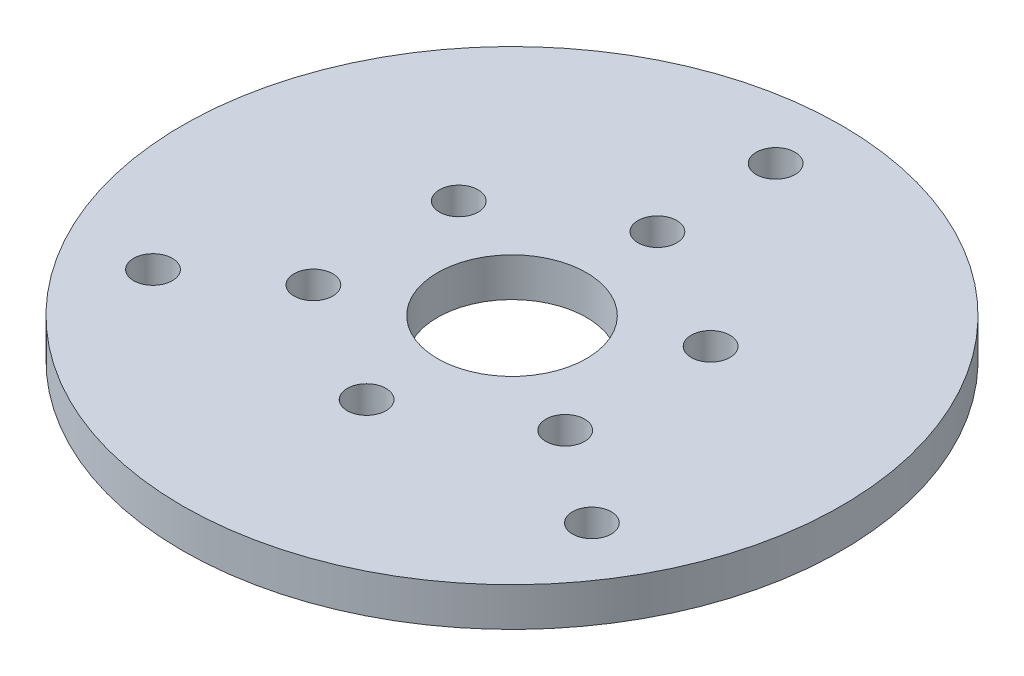
ISO-10303-21;
HEADER;
FILE_DESCRIPTION(('STEP AP214'),'2;1');
FILE_NAME('part.step','',(''),(''),'','','');
FILE_SCHEMA(('AUTOMOTIVE_DESIGN { 1 0 10303 214 1 1 1 1 }'));
ENDSEC;
DATA;
#1=APPLICATION_CONTEXT('core data for automotive mechanical design processes');
#2=APPLICATION_PROTOCOL_DEFINITION('international standard','automotive_design',2000,#1);
#3=PRODUCT_CONTEXT('',#1,'mechanical');
#4=PRODUCT('Part','Part','',(#3));
#5=PRODUCT_RELATED_PRODUCT_CATEGORY('part','',(#4));
#6=PRODUCT_DEFINITION_FORMATION('','',#4);
#7=PRODUCT_DEFINITION_CONTEXT('part definition',#1,'design');
#8=PRODUCT_DEFINITION('design','',#6,#7);
#9=PRODUCT_DEFINITION_SHAPE('','',#8);
#10=(LENGTH_UNIT() NAMED_UNIT(*) SI_UNIT(.MILLI.,.METRE.));
#11=(NAMED_UNIT(*) PLANE_ANGLE_UNIT() SI_UNIT($,.RADIAN.));
#12=(NAMED_UNIT(*) SI_UNIT($,.STERADIAN.) SOLID_ANGLE_UNIT());
#13=UNCERTAINTY_MEASURE_WITH_UNIT(LENGTH_MEASURE(1.E-05),#10,'distance_accuracy_value','');
#14=(GEOMETRIC_REPRESENTATION_CONTEXT(3) GLOBAL_UNCERTAINTY_ASSIGNED_CONTEXT((#13)) GLOBAL_UNIT_ASSIGNED_CONTEXT((#10,
#11,#12)) REPRESENTATION_CONTEXT('',''));
#15=CARTESIAN_POINT('',(0.,0.,0.));
#16=DIRECTION('',(0.,0.,1.));
#17=DIRECTION('',(1.,0.,0.));
#18=AXIS2_PLACEMENT_3D('',#15,#16,#17);
#19=CARTESIAN_POINT('',(0.,6.35,0.));
#20=DIRECTION('',(0.,1.,0.));
#21=DIRECTION('',(0.,0.,1.));
#22=AXIS2_PLACEMENT_3D('',#19,#20,#21);
#23=PLANE('',#22);
#24=CARTESIAN_POINT('',(0.,6.35,-23.8125));
#25=DIRECTION('',(0.,1.,0.));
#26=DIRECTION('',(0.,0.,1.));
#27=AXIS2_PLACEMENT_3D('',#24,#25,#26);
#28=CIRCLE('',#27,3.175);
#29=CARTESIAN_POINT('',(0.,6.35,-20.6375));
#30=VERTEX_POINT('',#29);
#31=EDGE_CURVE('E87',#30,#30,#28,.T.);
#32=ORIENTED_EDGE('',*,*,#31,.F.);
#33=EDGE_LOOP('',(#32));
#34=FACE_BOUND('',#33,.T.);
#35=CARTESIAN_POINT('',(0.,6.35,23.8125));
#36=DIRECTION('',(0.,1.,0.));
#37=DIRECTION('',(0.,0.,1.));
#38=AXIS2_PLACEMENT_3D('',#35,#36,#37);
#39=CIRCLE('',#38,3.175);
#40=CARTESIAN_POINT('',(0.,6.35,26.9875));
#41=VERTEX_POINT('',#40);
#42=EDGE_CURVE('E73',#41,#41,#39,.T.);
#43=ORIENTED_EDGE('',*,*,#42,.F.);
#44=EDGE_LOOP('',(#43));
#45=FACE_BOUND('',#44,.T.);
#46=CARTESIAN_POINT('',(20.6222299276169,6.35,11.90625));
#47=DIRECTION('',(0.,1.,0.));
#48=DIRECTION('',(0.,0.,1.));
#49=AXIS2_PLACEMENT_3D('',#46,#47,#48);
#50=CIRCLE('',#49,3.175);
#51=CARTESIAN_POINT('',(20.6222299276169,6.35,15.08125));
#52=VERTEX_POINT('',#51);
#53=EDGE_CURVE('E93',#52,#52,#50,.T.);
#54=ORIENTED_EDGE('',*,*,#53,.F.);
#55=EDGE_LOOP('',(#54));
#56=FACE_BOUND('',#55,.T.);
#57=CARTESIAN_POINT('',(20.6222299276169,6.35,-11.90625));
#58=DIRECTION('',(0.,1.,0.));
#59=DIRECTION('',(0.,0.,1.));
#60=AXIS2_PLACEMENT_3D('',#57,#58,#59);
#61=CIRCLE('',#60,3.175);
#62=CARTESIAN_POINT('',(20.6222299276169,6.35,-8.73125000000001));
#63=VERTEX_POINT('',#62);
#64=EDGE_CURVE('E74',#63,#63,#61,.T.);
#65=ORIENTED_EDGE('',*,*,#64,.F.);
#66=EDGE_LOOP('',(#65));
#67=FACE_BOUND('',#66,.T.);
#68=CARTESIAN_POINT('',(0.,6.35,0.));
#69=DIRECTION('',(0.,1.,0.));
#70=DIRECTION('',(0.,0.,1.));
#71=AXIS2_PLACEMENT_3D('',#68,#69,#70);
#72=CIRCLE('',#71,12.2);
#73=CARTESIAN_POINT('',(0.,6.35,12.2));
#74=VERTEX_POINT('',#73);
#75=EDGE_CURVE('E81',#74,#74,#72,.T.);
#76=ORIENTED_EDGE('',*,*,#75,.F.);
#77=EDGE_LOOP('',(#76));
#78=FACE_BOUND('',#77,.T.);
#79=CARTESIAN_POINT('',(-20.6222299276169,6.35,11.90625));
#80=DIRECTION('',(0.,1.,0.));
#81=DIRECTION('',(0.,0.,1.));
#82=AXIS2_PLACEMENT_3D('',#79,#80,#81);
#83=CIRCLE('',#82,3.175);
#84=CARTESIAN_POINT('',(-20.6222299276169,6.35,15.08125));
#85=VERTEX_POINT('',#84);
#86=EDGE_CURVE('E67',#85,#85,#83,.T.);
#87=ORIENTED_EDGE('',*,*,#86,.F.);
#88=EDGE_LOOP('',(#87));
#89=FACE_BOUND('',#88,.T.);
#90=CARTESIAN_POINT('',(-20.622229927617,6.35,-11.90625));
#91=DIRECTION('',(0.,1.,0.));
#92=DIRECTION('',(0.,0.,1.));
#93=AXIS2_PLACEMENT_3D('',#90,#91,#92);
#94=CIRCLE('',#93,3.175);
#95=CARTESIAN_POINT('',(-20.622229927617,6.35,-8.73124999999998));
#96=VERTEX_POINT('',#95);
#97=EDGE_CURVE('E61',#96,#96,#94,.T.);
#98=ORIENTED_EDGE('',*,*,#97,.F.);
#99=EDGE_LOOP('',(#98));
#100=FACE_BOUND('',#99,.T.);
#101=CARTESIAN_POINT('',(35.941,6.35,22.86));
#102=DIRECTION('',(0.,1.,0.));
#103=DIRECTION('',(0.,0.,1.));
#104=AXIS2_PLACEMENT_3D('',#101,#102,#103);
#105=CIRCLE('',#104,3.175);
#106=CARTESIAN_POINT('',(35.941,6.35,26.035));
#107=VERTEX_POINT('',#106);
#108=EDGE_CURVE('E46',#107,#107,#105,.T.);
#109=ORIENTED_EDGE('',*,*,#108,.F.);
#110=EDGE_LOOP('',(#109));
#111=FACE_BOUND('',#110,.T.);
#112=CARTESIAN_POINT('',(0.,6.35,0.));
#113=DIRECTION('',(0.,1.,0.));
#114=DIRECTION('',(0.,0.,1.));
#115=AXIS2_PLACEMENT_3D('',#112,#113,#114);
#116=CIRCLE('',#115,53.975);
#117=CARTESIAN_POINT('',(0.,6.35,53.975));
#118=VERTEX_POINT('',#117);
#119=EDGE_CURVE('E10',#118,#118,#116,.T.);
#120=ORIENTED_EDGE('',*,*,#119,.T.);
#121=EDGE_LOOP('',(#120));
#122=FACE_BOUND('',#121,.T.);
#123=CARTESIAN_POINT('',(0.,6.35,-43.18));
#124=DIRECTION('',(0.,1.,0.));
#125=DIRECTION('',(0.,0.,1.));
#126=AXIS2_PLACEMENT_3D('',#123,#124,#125);
#127=CIRCLE('',#126,3.175);
#128=CARTESIAN_POINT('',(0.,6.35,-40.005));
#129=VERTEX_POINT('',#128);
#130=EDGE_CURVE('E41',#129,#129,#127,.T.);
#131=ORIENTED_EDGE('',*,*,#130,.F.);
#132=EDGE_LOOP('',(#131));
#133=FACE_BOUND('',#132,.T.);
#134=CARTESIAN_POINT('',(-35.941,6.35,22.86));
#135=DIRECTION('',(0.,1.,0.));
#136=DIRECTION('',(0.,0.,1.));
#137=AXIS2_PLACEMENT_3D('',#134,#135,#136);
#138=CIRCLE('',#137,3.175);
#139=CARTESIAN_POINT('',(-35.941,6.35,26.035));
#140=VERTEX_POINT('',#139);
#141=EDGE_CURVE('E52',#140,#140,#138,.T.);
#142=ORIENTED_EDGE('',*,*,#141,.F.);
#143=EDGE_LOOP('',(#142));
#144=FACE_BOUND('',#143,.T.);
#145=ADVANCED_FACE('F30',(#34,#45,#56,#67,#78,#89,#100,#111,#122,#133,#144),#23,.T.);
#146=CARTESIAN_POINT('',(0.,0.,0.));
#147=DIRECTION('',(0.,1.,0.));
#148=DIRECTION('',(0.,0.,1.));
#149=AXIS2_PLACEMENT_3D('',#146,#147,#148);
#150=PLANE('',#149);
#151=CARTESIAN_POINT('',(0.,0.,-23.8125));
#152=DIRECTION('',(0.,1.,0.));
#153=DIRECTION('',(0.,0.,1.));
#154=AXIS2_PLACEMENT_3D('',#151,#152,#153);
#155=CIRCLE('',#154,3.175);
#156=CARTESIAN_POINT('',(0.,0.,-20.6375));
#157=VERTEX_POINT('',#156);
#158=EDGE_CURVE('E58',#157,#157,#155,.T.);
#159=ORIENTED_EDGE('',*,*,#158,.T.);
#160=EDGE_LOOP('',(#159));
#161=FACE_BOUND('',#160,.T.);
#162=CARTESIAN_POINT('',(0.,0.,23.8125));
#163=DIRECTION('',(0.,1.,0.));
#164=DIRECTION('',(0.,0.,1.));
#165=AXIS2_PLACEMENT_3D('',#162,#163,#164);
#166=CIRCLE('',#165,3.175);
#167=CARTESIAN_POINT('',(0.,0.,26.9875));
#168=VERTEX_POINT('',#167);
#169=EDGE_CURVE('E90',#168,#168,#166,.T.);
#170=ORIENTED_EDGE('',*,*,#169,.T.);
#171=EDGE_LOOP('',(#170));
#172=FACE_BOUND('',#171,.T.);
#173=CARTESIAN_POINT('',(20.6222299276169,0.,11.90625));
#174=DIRECTION('',(0.,1.,0.));
#175=DIRECTION('',(0.,0.,1.));
#176=AXIS2_PLACEMENT_3D('',#173,#174,#175);
#177=CIRCLE('',#176,3.175);
#178=CARTESIAN_POINT('',(20.6222299276169,0.,15.08125));
#179=VERTEX_POINT('',#178);
#180=EDGE_CURVE('E78',#179,#179,#177,.T.);
#181=ORIENTED_EDGE('',*,*,#180,.T.);
#182=EDGE_LOOP('',(#181));
#183=FACE_BOUND('',#182,.T.);
#184=CARTESIAN_POINT('',(20.6222299276169,0.,-11.90625));
#185=DIRECTION('',(0.,1.,0.));
#186=DIRECTION('',(0.,0.,1.));
#187=AXIS2_PLACEMENT_3D('',#184,#185,#186);
#188=CIRCLE('',#187,3.175);
#189=CARTESIAN_POINT('',(20.6222299276169,0.,-8.73125000000001));
#190=VERTEX_POINT('',#189);
#191=EDGE_CURVE('E77',#190,#190,#188,.T.);
#192=ORIENTED_EDGE('',*,*,#191,.T.);
#193=EDGE_LOOP('',(#192));
#194=FACE_BOUND('',#193,.T.);
#195=CARTESIAN_POINT('',(0.,0.,0.));
#196=DIRECTION('',(0.,1.,0.));
#197=DIRECTION('',(0.,0.,1.));
#198=AXIS2_PLACEMENT_3D('',#195,#196,#197);
#199=CIRCLE('',#198,12.2);
#200=CARTESIAN_POINT('',(0.,0.,12.2));
#201=VERTEX_POINT('',#200);
#202=EDGE_CURVE('E84',#201,#201,#199,.T.);
#203=ORIENTED_EDGE('',*,*,#202,.T.);
#204=EDGE_LOOP('',(#203));
#205=FACE_BOUND('',#204,.T.);
#206=CARTESIAN_POINT('',(-20.6222299276169,0.,11.90625));
#207=DIRECTION('',(0.,1.,0.));
#208=DIRECTION('',(0.,0.,1.));
#209=AXIS2_PLACEMENT_3D('',#206,#207,#208);
#210=CIRCLE('',#209,3.175);
#211=CARTESIAN_POINT('',(-20.6222299276169,0.,15.08125));
#212=VERTEX_POINT('',#211);
#213=EDGE_CURVE('E70',#212,#212,#210,.T.);
#214=ORIENTED_EDGE('',*,*,#213,.T.);
#215=EDGE_LOOP('',(#214));
#216=FACE_BOUND('',#215,.T.);
#217=CARTESIAN_POINT('',(-20.622229927617,0.,-11.90625));
#218=DIRECTION('',(0.,1.,0.));
#219=DIRECTION('',(0.,0.,1.));
#220=AXIS2_PLACEMENT_3D('',#217,#218,#219);
#221=CIRCLE('',#220,3.175);
#222=CARTESIAN_POINT('',(-20.622229927617,0.,-8.73124999999998));
#223=VERTEX_POINT('',#222);
#224=EDGE_CURVE('E64',#223,#223,#221,.T.);
#225=ORIENTED_EDGE('',*,*,#224,.T.);
#226=EDGE_LOOP('',(#225));
#227=FACE_BOUND('',#226,.T.);
#228=CARTESIAN_POINT('',(0.,0.,0.));
#229=DIRECTION('',(0.,1.,0.));
#230=DIRECTION('',(0.,0.,1.));
#231=AXIS2_PLACEMENT_3D('',#228,#229,#230);
#232=CIRCLE('',#231,53.975);
#233=CARTESIAN_POINT('',(0.,0.,53.975));
#234=VERTEX_POINT('',#233);
#235=EDGE_CURVE('E34',#234,#234,#232,.T.);
#236=ORIENTED_EDGE('',*,*,#235,.F.);
#237=EDGE_LOOP('',(#236));
#238=FACE_BOUND('',#237,.T.);
#239=CARTESIAN_POINT('',(0.,0.,-43.18));
#240=DIRECTION('',(0.,1.,0.));
#241=DIRECTION('',(0.,0.,1.));
#242=AXIS2_PLACEMENT_3D('',#239,#240,#241);
#243=CIRCLE('',#242,3.175);
#244=CARTESIAN_POINT('',(0.,0.,-40.005));
#245=VERTEX_POINT('',#244);
#246=EDGE_CURVE('E43',#245,#245,#243,.T.);
#247=ORIENTED_EDGE('',*,*,#246,.T.);
#248=EDGE_LOOP('',(#247));
#249=FACE_BOUND('',#248,.T.);
#250=CARTESIAN_POINT('',(35.941,0.,22.86));
#251=DIRECTION('',(0.,1.,0.));
#252=DIRECTION('',(0.,0.,1.));
#253=AXIS2_PLACEMENT_3D('',#250,#251,#252);
#254=CIRCLE('',#253,3.175);
#255=CARTESIAN_POINT('',(35.941,0.,26.035));
#256=VERTEX_POINT('',#255);
#257=EDGE_CURVE('E49',#256,#256,#254,.T.);
#258=ORIENTED_EDGE('',*,*,#257,.T.);
#259=EDGE_LOOP('',(#258));
#260=FACE_BOUND('',#259,.T.);
#261=CARTESIAN_POINT('',(-35.941,0.,22.86));
#262=DIRECTION('',(0.,1.,0.));
#263=DIRECTION('',(0.,0.,1.));
#264=AXIS2_PLACEMENT_3D('',#261,#262,#263);
#265=CIRCLE('',#264,3.175);
#266=CARTESIAN_POINT('',(-35.941,0.,26.035));
#267=VERTEX_POINT('',#266);
#268=EDGE_CURVE('E55',#267,#267,#265,.T.);
#269=ORIENTED_EDGE('',*,*,#268,.T.);
#270=EDGE_LOOP('',(#269));
#271=FACE_BOUND('',#270,.T.);
#272=ADVANCED_FACE('F103',(#161,#172,#183,#194,#205,#216,#227,#238,#249,#260,#271),#150,.F.);
#273=CARTESIAN_POINT('',(0.,6.35,0.));
#274=DIRECTION('',(0.,-1.,0.));
#275=DIRECTION('',(0.,0.,-1.));
#276=AXIS2_PLACEMENT_3D('',#273,#274,#275);
#277=CYLINDRICAL_SURFACE('',#276,53.975);
#278=ORIENTED_EDGE('',*,*,#119,.F.);
#279=EDGE_LOOP('',(#278));
#280=FACE_BOUND('',#279,.T.);
#281=ORIENTED_EDGE('',*,*,#235,.T.);
#282=EDGE_LOOP('',(#281));
#283=FACE_BOUND('',#282,.T.);
#284=ADVANCED_FACE('F32',(#280,#283),#277,.T.);
#285=CARTESIAN_POINT('',(0.,6.35,-43.18));
#286=DIRECTION('',(0.,-1.,0.));
#287=DIRECTION('',(0.,0.,-1.));
#288=AXIS2_PLACEMENT_3D('',#285,#286,#287);
#289=CYLINDRICAL_SURFACE('',#288,3.175);
#290=ORIENTED_EDGE('',*,*,#130,.T.);
#291=EDGE_LOOP('',(#290));
#292=FACE_BOUND('',#291,.T.);
#293=ORIENTED_EDGE('',*,*,#246,.F.);
#294=EDGE_LOOP('',(#293));
#295=FACE_BOUND('',#294,.T.);
#296=ADVANCED_FACE('F146',(#292,#295),#289,.F.);
#297=CARTESIAN_POINT('',(35.941,6.35,22.86));
#298=DIRECTION('',(0.,-1.,0.));
#299=DIRECTION('',(0.,0.,-1.));
#300=AXIS2_PLACEMENT_3D('',#297,#298,#299);
#301=CYLINDRICAL_SURFACE('',#300,3.175);
#302=ORIENTED_EDGE('',*,*,#108,.T.);
#303=EDGE_LOOP('',(#302));
#304=FACE_BOUND('',#303,.T.);
#305=ORIENTED_EDGE('',*,*,#257,.F.);
#306=EDGE_LOOP('',(#305));
#307=FACE_BOUND('',#306,.T.);
#308=ADVANCED_FACE('F138',(#304,#307),#301,.F.);
#309=CARTESIAN_POINT('',(-35.941,6.35,22.86));
#310=DIRECTION('',(0.,-1.,0.));
#311=DIRECTION('',(0.,0.,-1.));
#312=AXIS2_PLACEMENT_3D('',#309,#310,#311);
#313=CYLINDRICAL_SURFACE('',#312,3.175);
#314=ORIENTED_EDGE('',*,*,#141,.T.);
#315=EDGE_LOOP('',(#314));
#316=FACE_BOUND('',#315,.T.);
#317=ORIENTED_EDGE('',*,*,#268,.F.);
#318=EDGE_LOOP('',(#317));
#319=FACE_BOUND('',#318,.T.);
#320=ADVANCED_FACE('F134',(#316,#319),#313,.F.);
#321=CARTESIAN_POINT('',(-20.622229927617,0.,-11.90625));
#322=DIRECTION('',(0.,1.,0.));
#323=DIRECTION('',(0.,0.,1.));
#324=AXIS2_PLACEMENT_3D('',#321,#322,#323);
#325=CYLINDRICAL_SURFACE('',#324,3.175);
#326=ORIENTED_EDGE('',*,*,#224,.F.);
#327=EDGE_LOOP('',(#326));
#328=FACE_BOUND('',#327,.T.);
#329=ORIENTED_EDGE('',*,*,#97,.T.);
#330=EDGE_LOOP('',(#329));
#331=FACE_BOUND('',#330,.T.);
#332=ADVANCED_FACE('F137',(#328,#331),#325,.F.);
#333=CARTESIAN_POINT('',(-20.6222299276169,0.,11.90625));
#334=DIRECTION('',(0.,1.,0.));
#335=DIRECTION('',(0.,0.,1.));
#336=AXIS2_PLACEMENT_3D('',#333,#334,#335);
#337=CYLINDRICAL_SURFACE('',#336,3.175);
#338=ORIENTED_EDGE('',*,*,#213,.F.);
#339=EDGE_LOOP('',(#338));
#340=FACE_BOUND('',#339,.T.);
#341=ORIENTED_EDGE('',*,*,#86,.T.);
#342=EDGE_LOOP('',(#341));
#343=FACE_BOUND('',#342,.T.);
#344=ADVANCED_FACE('F157',(#340,#343),#337,.F.);
#345=CARTESIAN_POINT('',(0.,0.,0.));
#346=DIRECTION('',(0.,1.,0.));
#347=DIRECTION('',(0.,0.,1.));
#348=AXIS2_PLACEMENT_3D('',#345,#346,#347);
#349=CYLINDRICAL_SURFACE('',#348,12.2);
#350=ORIENTED_EDGE('',*,*,#202,.F.);
#351=EDGE_LOOP('',(#350));
#352=FACE_BOUND('',#351,.T.);
#353=ORIENTED_EDGE('',*,*,#75,.T.);
#354=EDGE_LOOP('',(#353));
#355=FACE_BOUND('',#354,.T.);
#356=ADVANCED_FACE('F161',(#352,#355),#349,.F.);
#357=CARTESIAN_POINT('',(20.6222299276169,0.,-11.90625));
#358=DIRECTION('',(0.,1.,0.));
#359=DIRECTION('',(0.,0.,1.));
#360=AXIS2_PLACEMENT_3D('',#357,#358,#359);
#361=CYLINDRICAL_SURFACE('',#360,3.175);
#362=ORIENTED_EDGE('',*,*,#191,.F.);
#363=EDGE_LOOP('',(#362));
#364=FACE_BOUND('',#363,.T.);
#365=ORIENTED_EDGE('',*,*,#64,.T.);
#366=EDGE_LOOP('',(#365));
#367=FACE_BOUND('',#366,.T.);
#368=ADVANCED_FACE('F163',(#364,#367),#361,.F.);
#369=CARTESIAN_POINT('',(20.6222299276169,0.,11.90625));
#370=DIRECTION('',(0.,1.,0.));
#371=DIRECTION('',(0.,0.,1.));
#372=AXIS2_PLACEMENT_3D('',#369,#370,#371);
#373=CYLINDRICAL_SURFACE('',#372,3.175);
#374=ORIENTED_EDGE('',*,*,#180,.F.);
#375=EDGE_LOOP('',(#374));
#376=FACE_BOUND('',#375,.T.);
#377=ORIENTED_EDGE('',*,*,#53,.T.);
#378=EDGE_LOOP('',(#377));
#379=FACE_BOUND('',#378,.T.);
#380=ADVANCED_FACE('F166',(#376,#379),#373,.F.);
#381=CARTESIAN_POINT('',(0.,0.,23.8125));
#382=DIRECTION('',(0.,1.,0.));
#383=DIRECTION('',(0.,0.,1.));
#384=AXIS2_PLACEMENT_3D('',#381,#382,#383);
#385=CYLINDRICAL_SURFACE('',#384,3.175);
#386=ORIENTED_EDGE('',*,*,#169,.F.);
#387=EDGE_LOOP('',(#386));
#388=FACE_BOUND('',#387,.T.);
#389=ORIENTED_EDGE('',*,*,#42,.T.);
#390=EDGE_LOOP('',(#389));
#391=FACE_BOUND('',#390,.T.);
#392=ADVANCED_FACE('F109',(#388,#391),#385,.F.);
#393=CARTESIAN_POINT('',(0.,0.,-23.8125));
#394=DIRECTION('',(0.,1.,0.));
#395=DIRECTION('',(0.,0.,1.));
#396=AXIS2_PLACEMENT_3D('',#393,#394,#395);
#397=CYLINDRICAL_SURFACE('',#396,3.175);
#398=ORIENTED_EDGE('',*,*,#158,.F.);
#399=EDGE_LOOP('',(#398));
#400=FACE_BOUND('',#399,.T.);
#401=ORIENTED_EDGE('',*,*,#31,.T.);
#402=EDGE_LOOP('',(#401));
#403=FACE_BOUND('',#402,.T.);
#404=ADVANCED_FACE('F106',(#400,#403),#397,.F.);
#405=CLOSED_SHELL('',(#145,#272,#284,#296,#308,#320,#332,#344,#356,#368,#380,#392,#404));
#406=MANIFOLD_SOLID_BREP('B2',#405);
#407=ADVANCED_BREP_SHAPE_REPRESENTATION('',(#18,#406),#14);
#408=SHAPE_DEFINITION_REPRESENTATION(#9,#407);
ENDSEC;
END-ISO-10303-21;
